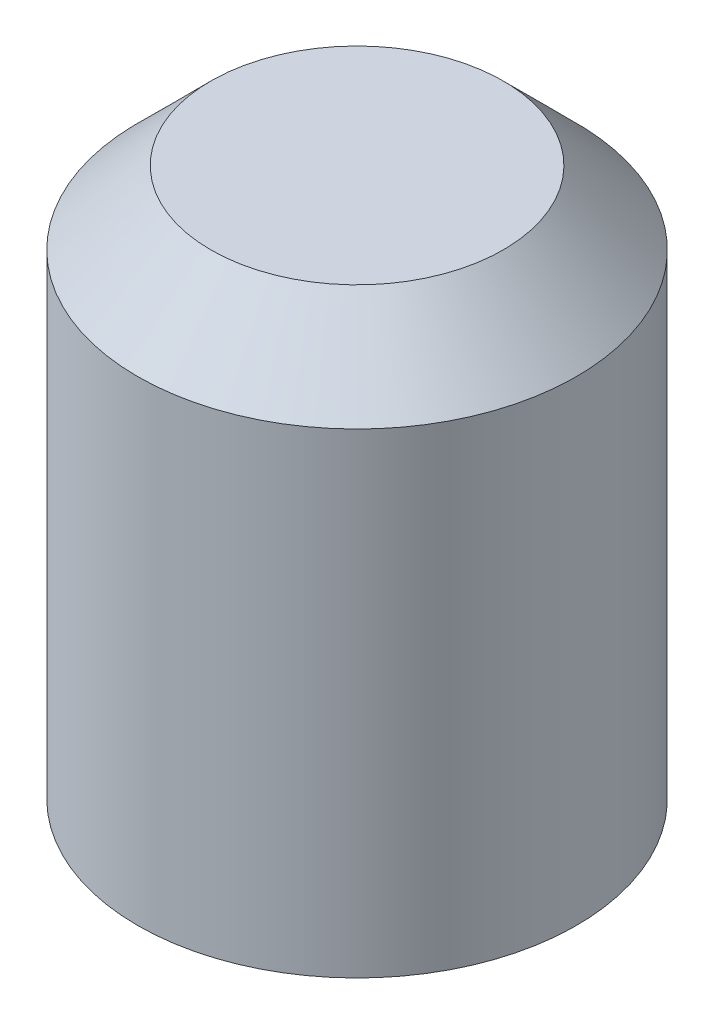
ISO-10303-21;
HEADER;
FILE_DESCRIPTION(('STEP AP214'),'2;1');
FILE_NAME('part.step','',(''),(''),'','','');
FILE_SCHEMA(('AUTOMOTIVE_DESIGN { 1 0 10303 214 1 1 1 1 }'));
ENDSEC;
DATA;
#1=APPLICATION_CONTEXT('core data for automotive mechanical design processes');
#2=APPLICATION_PROTOCOL_DEFINITION('international standard','automotive_design',2000,#1);
#3=PRODUCT_CONTEXT('',#1,'mechanical');
#4=PRODUCT('Part','Part','',(#3));
#5=PRODUCT_RELATED_PRODUCT_CATEGORY('part','',(#4));
#6=PRODUCT_DEFINITION_FORMATION('','',#4);
#7=PRODUCT_DEFINITION_CONTEXT('part definition',#1,'design');
#8=PRODUCT_DEFINITION('design','',#6,#7);
#9=PRODUCT_DEFINITION_SHAPE('','',#8);
#10=(LENGTH_UNIT() NAMED_UNIT(*) SI_UNIT(.MILLI.,.METRE.));
#11=(NAMED_UNIT(*) PLANE_ANGLE_UNIT() SI_UNIT($,.RADIAN.));
#12=(NAMED_UNIT(*) SI_UNIT($,.STERADIAN.) SOLID_ANGLE_UNIT());
#13=UNCERTAINTY_MEASURE_WITH_UNIT(LENGTH_MEASURE(1.E-05),#10,'distance_accuracy_value','');
#14=(GEOMETRIC_REPRESENTATION_CONTEXT(3) GLOBAL_UNCERTAINTY_ASSIGNED_CONTEXT((#13)) GLOBAL_UNIT_ASSIGNED_CONTEXT((#10,
#11,#12)) REPRESENTATION_CONTEXT('',''));
#15=CARTESIAN_POINT('',(0.,0.,0.));
#16=DIRECTION('',(0.,0.,1.));
#17=DIRECTION('',(1.,0.,0.));
#18=AXIS2_PLACEMENT_3D('',#15,#16,#17);
#19=CARTESIAN_POINT('',(0.,15.,0.));
#20=DIRECTION('',(0.,-1.,0.));
#21=DIRECTION('',(0.,0.,-1.));
#22=AXIS2_PLACEMENT_3D('',#19,#20,#21);
#23=CYLINDRICAL_SURFACE('',#22,6.);
#24=CARTESIAN_POINT('',(0.,13.,0.));
#25=DIRECTION('',(0.,1.,0.));
#26=DIRECTION('',(0.,0.,1.));
#27=AXIS2_PLACEMENT_3D('',#24,#25,#26);
#28=CIRCLE('',#27,6.);
#29=CARTESIAN_POINT('',(0.,13.,6.));
#30=VERTEX_POINT('',#29);
#31=EDGE_CURVE('E10',#30,#30,#28,.F.);
#32=ORIENTED_EDGE('',*,*,#31,.T.);
#33=EDGE_LOOP('',(#32));
#34=FACE_BOUND('',#33,.T.);
#35=CARTESIAN_POINT('',(0.,0.,0.));
#36=DIRECTION('',(0.,1.,0.));
#37=DIRECTION('',(0.,0.,1.));
#38=AXIS2_PLACEMENT_3D('',#35,#36,#37);
#39=CIRCLE('',#38,6.);
#40=CARTESIAN_POINT('',(0.,0.,6.));
#41=VERTEX_POINT('',#40);
#42=EDGE_CURVE('E41',#41,#41,#39,.T.);
#43=ORIENTED_EDGE('',*,*,#42,.T.);
#44=EDGE_LOOP('',(#43));
#45=FACE_BOUND('',#44,.T.);
#46=ADVANCED_FACE('F30',(#34,#45),#23,.T.);
#47=CARTESIAN_POINT('',(0.,15.,0.));
#48=DIRECTION('',(0.,1.,0.));
#49=DIRECTION('',(0.,0.,1.));
#50=AXIS2_PLACEMENT_3D('',#47,#48,#49);
#51=PLANE('',#50);
#52=CARTESIAN_POINT('',(0.,15.,0.));
#53=DIRECTION('',(0.,1.,0.));
#54=DIRECTION('',(0.,0.,1.));
#55=AXIS2_PLACEMENT_3D('',#52,#53,#54);
#56=CIRCLE('',#55,4.);
#57=CARTESIAN_POINT('',(0.,15.,4.));
#58=VERTEX_POINT('',#57);
#59=EDGE_CURVE('E37',#58,#58,#56,.T.);
#60=ORIENTED_EDGE('',*,*,#59,.T.);
#61=EDGE_LOOP('',(#60));
#62=FACE_BOUND('',#61,.T.);
#63=ADVANCED_FACE('F51',(#62),#51,.T.);
#64=CARTESIAN_POINT('',(0.,0.,0.));
#65=DIRECTION('',(0.,1.,0.));
#66=DIRECTION('',(0.,0.,1.));
#67=AXIS2_PLACEMENT_3D('',#64,#65,#66);
#68=PLANE('',#67);
#69=ORIENTED_EDGE('',*,*,#42,.F.);
#70=EDGE_LOOP('',(#69));
#71=FACE_BOUND('',#70,.T.);
#72=ADVANCED_FACE('F49',(#71),#68,.F.);
#73=CARTESIAN_POINT('',(0.,15.,0.));
#74=DIRECTION('',(0.,-1.,0.));
#75=DIRECTION('',(0.,0.,-1.));
#76=AXIS2_PLACEMENT_3D('',#73,#74,#75);
#77=CONICAL_SURFACE('',#76,4.,0.785398163397447);
#78=ORIENTED_EDGE('',*,*,#31,.F.);
#79=EDGE_LOOP('',(#78));
#80=FACE_BOUND('',#79,.T.);
#81=ORIENTED_EDGE('',*,*,#59,.F.);
#82=EDGE_LOOP('',(#81));
#83=FACE_BOUND('',#82,.T.);
#84=ADVANCED_FACE('F32',(#80,#83),#77,.T.);
#85=CLOSED_SHELL('',(#46,#63,#72,#84));
#86=MANIFOLD_SOLID_BREP('B2',#85);
#87=ADVANCED_BREP_SHAPE_REPRESENTATION('',(#18,#86),#14);
#88=SHAPE_DEFINITION_REPRESENTATION(#9,#87);
ENDSEC;
END-ISO-10303-21;
